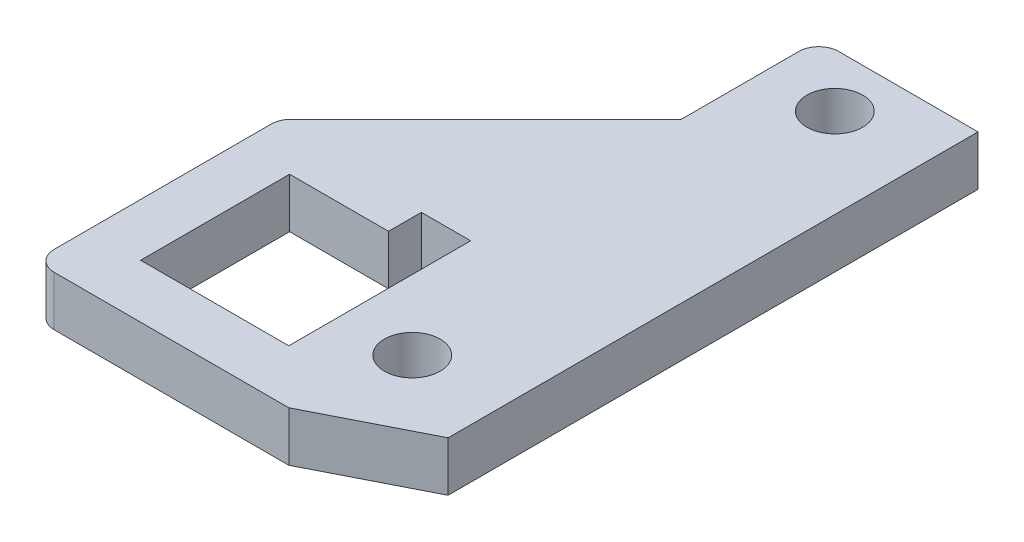
ISO-10303-21;
HEADER;
FILE_DESCRIPTION(('STEP AP214'),'2;1');
FILE_NAME('part.step','',(''),(''),'','','');
FILE_SCHEMA(('AUTOMOTIVE_DESIGN { 1 0 10303 214 1 1 1 1 }'));
ENDSEC;
DATA;
#1=APPLICATION_CONTEXT('core data for automotive mechanical design processes');
#2=APPLICATION_PROTOCOL_DEFINITION('international standard','automotive_design',2000,#1);
#3=PRODUCT_CONTEXT('',#1,'mechanical');
#4=PRODUCT('Part','Part','',(#3));
#5=PRODUCT_RELATED_PRODUCT_CATEGORY('part','',(#4));
#6=PRODUCT_DEFINITION_FORMATION('','',#4);
#7=PRODUCT_DEFINITION_CONTEXT('part definition',#1,'design');
#8=PRODUCT_DEFINITION('design','',#6,#7);
#9=PRODUCT_DEFINITION_SHAPE('','',#8);
#10=(LENGTH_UNIT() NAMED_UNIT(*) SI_UNIT(.MILLI.,.METRE.));
#11=(NAMED_UNIT(*) PLANE_ANGLE_UNIT() SI_UNIT($,.RADIAN.));
#12=(NAMED_UNIT(*) SI_UNIT($,.STERADIAN.) SOLID_ANGLE_UNIT());
#13=UNCERTAINTY_MEASURE_WITH_UNIT(LENGTH_MEASURE(1.E-05),#10,'distance_accuracy_value','');
#14=(GEOMETRIC_REPRESENTATION_CONTEXT(3) GLOBAL_UNCERTAINTY_ASSIGNED_CONTEXT((#13)) GLOBAL_UNIT_ASSIGNED_CONTEXT((#10,
#11,#12)) REPRESENTATION_CONTEXT('',''));
#15=CARTESIAN_POINT('',(0.,0.,0.));
#16=DIRECTION('',(0.,0.,1.));
#17=DIRECTION('',(1.,0.,0.));
#18=AXIS2_PLACEMENT_3D('',#15,#16,#17);
#19=CARTESIAN_POINT('',(1.27,3.175,-1.27));
#20=DIRECTION('',(0.,-1.,0.));
#21=DIRECTION('',(0.,0.,-1.));
#22=AXIS2_PLACEMENT_3D('',#19,#20,#21);
#23=CYLINDRICAL_SURFACE('',#22,1.27);
#24=CARTESIAN_POINT('',(1.27,0.,-1.27));
#25=DIRECTION('',(0.,-1.,0.));
#26=DIRECTION('',(0.,0.,-1.));
#27=AXIS2_PLACEMENT_3D('',#24,#25,#26);
#28=CIRCLE('',#27,1.27);
#29=CARTESIAN_POINT('',(1.27,0.,0.));
#30=VERTEX_POINT('',#29);
#31=CARTESIAN_POINT('',(0.,0.,-1.27));
#32=VERTEX_POINT('',#31);
#33=EDGE_CURVE('E195',#30,#32,#28,.T.);
#34=ORIENTED_EDGE('',*,*,#33,.F.);
#35=DIRECTION('',(0.,-1.,0.));
#36=VECTOR('',#35,1.);
#37=CARTESIAN_POINT('',(1.27,3.175,0.));
#38=LINE('',#37,#36);
#39=CARTESIAN_POINT('',(1.27,3.175,0.));
#40=VERTEX_POINT('',#39);
#41=EDGE_CURVE('E11',#40,#30,#38,.T.);
#42=ORIENTED_EDGE('',*,*,#41,.F.);
#43=CARTESIAN_POINT('',(1.27,3.175,-1.27));
#44=DIRECTION('',(0.,-1.,0.));
#45=DIRECTION('',(0.,0.,-1.));
#46=AXIS2_PLACEMENT_3D('',#43,#44,#45);
#47=CIRCLE('',#46,1.27);
#48=CARTESIAN_POINT('',(0.,3.175,-1.27));
#49=VERTEX_POINT('',#48);
#50=EDGE_CURVE('E203',#40,#49,#47,.T.);
#51=ORIENTED_EDGE('',*,*,#50,.T.);
#52=DIRECTION('',(0.,-1.,0.));
#53=VECTOR('',#52,1.);
#54=CARTESIAN_POINT('',(0.,3.175,-1.27));
#55=LINE('',#54,#53);
#56=EDGE_CURVE('E36',#49,#32,#55,.T.);
#57=ORIENTED_EDGE('',*,*,#56,.T.);
#58=EDGE_LOOP('',(#34,#42,#51,#57));
#59=FACE_BOUND('',#58,.T.);
#60=ADVANCED_FACE('F33',(#59),#23,.T.);
#61=CARTESIAN_POINT('',(16.2239556670893,3.175,0.));
#62=DIRECTION('',(0.,0.,1.));
#63=DIRECTION('',(1.,0.,0.));
#64=AXIS2_PLACEMENT_3D('',#61,#62,#63);
#65=PLANE('',#64);
#66=DIRECTION('',(-1.,0.,0.));
#67=VECTOR('',#66,1.);
#68=CARTESIAN_POINT('',(16.2239556670893,0.,0.));
#69=LINE('',#68,#67);
#70=CARTESIAN_POINT('',(16.2239556670893,0.,0.));
#71=VERTEX_POINT('',#70);
#72=EDGE_CURVE('E207',#71,#30,#69,.T.);
#73=ORIENTED_EDGE('',*,*,#72,.F.);
#74=DIRECTION('',(0.,-1.,0.));
#75=VECTOR('',#74,1.);
#76=CARTESIAN_POINT('',(16.2239556670893,3.175,0.));
#77=LINE('',#76,#75);
#78=CARTESIAN_POINT('',(16.2239556670893,3.175,0.));
#79=VERTEX_POINT('',#78);
#80=EDGE_CURVE('E41',#79,#71,#77,.T.);
#81=ORIENTED_EDGE('',*,*,#80,.F.);
#82=DIRECTION('',(-1.,0.,0.));
#83=VECTOR('',#82,1.);
#84=CARTESIAN_POINT('',(16.2239556670893,3.175,0.));
#85=LINE('',#84,#83);
#86=EDGE_CURVE('E231',#79,#40,#85,.T.);
#87=ORIENTED_EDGE('',*,*,#86,.T.);
#88=ORIENTED_EDGE('',*,*,#41,.T.);
#89=EDGE_LOOP('',(#73,#81,#87,#88));
#90=FACE_BOUND('',#89,.T.);
#91=ADVANCED_FACE('F288',(#90),#65,.T.);
#92=CARTESIAN_POINT('',(22.9633593823173,3.175,-3.42057377293219));
#93=DIRECTION('',(0.452590350451546,0.,0.891718551269483));
#94=DIRECTION('',(0.891718551269483,0.,-0.452590350451546));
#95=AXIS2_PLACEMENT_3D('',#92,#93,#94);
#96=PLANE('',#95);
#97=DIRECTION('',(-0.891718551269483,0.,0.452590350451546));
#98=VECTOR('',#97,1.);
#99=CARTESIAN_POINT('',(22.9633593823173,0.,-3.42057377293219));
#100=LINE('',#99,#98);
#101=CARTESIAN_POINT('',(22.9633593823173,0.,-3.42057377293219));
#102=VERTEX_POINT('',#101);
#103=EDGE_CURVE('E257',#102,#71,#100,.T.);
#104=ORIENTED_EDGE('',*,*,#103,.F.);
#105=DIRECTION('',(0.,-1.,0.));
#106=VECTOR('',#105,1.);
#107=CARTESIAN_POINT('',(22.9633593823173,3.175,-3.42057377293219));
#108=LINE('',#107,#106);
#109=CARTESIAN_POINT('',(22.9633593823173,3.175,-3.42057377293219));
#110=VERTEX_POINT('',#109);
#111=EDGE_CURVE('E263',#110,#102,#108,.T.);
#112=ORIENTED_EDGE('',*,*,#111,.F.);
#113=DIRECTION('',(-0.891718551269483,0.,0.452590350451546));
#114=VECTOR('',#113,1.);
#115=CARTESIAN_POINT('',(22.9633593823173,3.175,-3.42057377293219));
#116=LINE('',#115,#114);
#117=EDGE_CURVE('E228',#110,#79,#116,.T.);
#118=ORIENTED_EDGE('',*,*,#117,.T.);
#119=ORIENTED_EDGE('',*,*,#80,.T.);
#120=EDGE_LOOP('',(#104,#112,#118,#119));
#121=FACE_BOUND('',#120,.T.);
#122=ADVANCED_FACE('F315',(#121),#96,.T.);
#123=CARTESIAN_POINT('',(22.9633593823173,3.175,-37.2025926));
#124=DIRECTION('',(1.,0.,0.));
#125=DIRECTION('',(0.,0.,-1.));
#126=AXIS2_PLACEMENT_3D('',#123,#124,#125);
#127=PLANE('',#126);
#128=DIRECTION('',(0.,0.,1.));
#129=VECTOR('',#128,1.);
#130=CARTESIAN_POINT('',(22.9633593823173,0.,-37.2025926));
#131=LINE('',#130,#129);
#132=CARTESIAN_POINT('',(22.9633593823173,0.,-37.2025926));
#133=VERTEX_POINT('',#132);
#134=EDGE_CURVE('E254',#133,#102,#131,.T.);
#135=ORIENTED_EDGE('',*,*,#134,.F.);
#136=DIRECTION('',(0.,-1.,0.));
#137=VECTOR('',#136,1.);
#138=CARTESIAN_POINT('',(22.9633593823173,3.175,-37.2025926));
#139=LINE('',#138,#137);
#140=CARTESIAN_POINT('',(22.9633593823173,3.175,-37.2025926));
#141=VERTEX_POINT('',#140);
#142=EDGE_CURVE('E265',#141,#133,#139,.T.);
#143=ORIENTED_EDGE('',*,*,#142,.F.);
#144=DIRECTION('',(0.,0.,1.));
#145=VECTOR('',#144,1.);
#146=CARTESIAN_POINT('',(22.9633593823173,3.175,-37.2025926));
#147=LINE('',#146,#145);
#148=EDGE_CURVE('E225',#141,#110,#147,.T.);
#149=ORIENTED_EDGE('',*,*,#148,.T.);
#150=ORIENTED_EDGE('',*,*,#111,.T.);
#151=EDGE_LOOP('',(#135,#143,#149,#150));
#152=FACE_BOUND('',#151,.T.);
#153=ADVANCED_FACE('F313',(#152),#127,.T.);
#154=CARTESIAN_POINT('',(14.0812333823173,3.175,-37.2025926));
#155=DIRECTION('',(0.,0.,-1.));
#156=DIRECTION('',(-1.,0.,0.));
#157=AXIS2_PLACEMENT_3D('',#154,#155,#156);
#158=PLANE('',#157);
#159=DIRECTION('',(1.,0.,0.));
#160=VECTOR('',#159,1.);
#161=CARTESIAN_POINT('',(14.0812333823173,0.,-37.2025926));
#162=LINE('',#161,#160);
#163=CARTESIAN_POINT('',(14.0812333823173,0.,-37.2025926));
#164=VERTEX_POINT('',#163);
#165=EDGE_CURVE('E251',#164,#133,#162,.T.);
#166=ORIENTED_EDGE('',*,*,#165,.F.);
#167=DIRECTION('',(0.,-1.,0.));
#168=VECTOR('',#167,1.);
#169=CARTESIAN_POINT('',(14.0812333823173,3.175,-37.2025926));
#170=LINE('',#169,#168);
#171=CARTESIAN_POINT('',(14.0812333823173,3.175,-37.2025926));
#172=VERTEX_POINT('',#171);
#173=EDGE_CURVE('E267',#172,#164,#170,.T.);
#174=ORIENTED_EDGE('',*,*,#173,.F.);
#175=DIRECTION('',(1.,0.,0.));
#176=VECTOR('',#175,1.);
#177=CARTESIAN_POINT('',(14.0812333823173,3.175,-37.2025926));
#178=LINE('',#177,#176);
#179=EDGE_CURVE('E222',#172,#141,#178,.T.);
#180=ORIENTED_EDGE('',*,*,#179,.T.);
#181=ORIENTED_EDGE('',*,*,#142,.T.);
#182=EDGE_LOOP('',(#166,#174,#180,#181));
#183=FACE_BOUND('',#182,.T.);
#184=ADVANCED_FACE('F309',(#183),#158,.T.);
#185=CARTESIAN_POINT('',(14.0812333823173,3.175,-35.9325926));
#186=DIRECTION('',(0.,-1.,0.));
#187=DIRECTION('',(0.,0.,-1.));
#188=AXIS2_PLACEMENT_3D('',#185,#186,#187);
#189=CYLINDRICAL_SURFACE('',#188,1.27);
#190=CARTESIAN_POINT('',(14.0812333823173,0.,-35.9325926));
#191=DIRECTION('',(0.,-1.,0.));
#192=DIRECTION('',(0.,0.,-1.));
#193=AXIS2_PLACEMENT_3D('',#190,#191,#192);
#194=CIRCLE('',#193,1.27);
#195=CARTESIAN_POINT('',(12.8112333823173,0.,-35.9325926));
#196=VERTEX_POINT('',#195);
#197=EDGE_CURVE('E248',#196,#164,#194,.T.);
#198=ORIENTED_EDGE('',*,*,#197,.F.);
#199=DIRECTION('',(0.,-1.,0.));
#200=VECTOR('',#199,1.);
#201=CARTESIAN_POINT('',(12.8112333823173,3.175,-35.9325926));
#202=LINE('',#201,#200);
#203=CARTESIAN_POINT('',(12.8112333823173,3.175,-35.9325926));
#204=VERTEX_POINT('',#203);
#205=EDGE_CURVE('E269',#204,#196,#202,.T.);
#206=ORIENTED_EDGE('',*,*,#205,.F.);
#207=CARTESIAN_POINT('',(14.0812333823173,3.175,-35.9325926));
#208=DIRECTION('',(0.,-1.,0.));
#209=DIRECTION('',(0.,0.,-1.));
#210=AXIS2_PLACEMENT_3D('',#207,#208,#209);
#211=CIRCLE('',#210,1.27);
#212=EDGE_CURVE('E219',#204,#172,#211,.T.);
#213=ORIENTED_EDGE('',*,*,#212,.T.);
#214=ORIENTED_EDGE('',*,*,#173,.T.);
#215=EDGE_LOOP('',(#198,#206,#213,#214));
#216=FACE_BOUND('',#215,.T.);
#217=ADVANCED_FACE('F305',(#216),#189,.T.);
#218=CARTESIAN_POINT('',(12.8112333823173,3.175,-28.4334966));
#219=DIRECTION('',(-1.,0.,0.));
#220=DIRECTION('',(0.,0.,1.));
#221=AXIS2_PLACEMENT_3D('',#218,#219,#220);
#222=PLANE('',#221);
#223=DIRECTION('',(0.,0.,-1.));
#224=VECTOR('',#223,1.);
#225=CARTESIAN_POINT('',(12.8112333823173,0.,-28.4334966));
#226=LINE('',#225,#224);
#227=CARTESIAN_POINT('',(12.8112333823173,0.,-28.4334966));
#228=VERTEX_POINT('',#227);
#229=EDGE_CURVE('E245',#228,#196,#226,.T.);
#230=ORIENTED_EDGE('',*,*,#229,.F.);
#231=DIRECTION('',(0.,-1.,0.));
#232=VECTOR('',#231,1.);
#233=CARTESIAN_POINT('',(12.8112333823173,3.175,-28.4334966));
#234=LINE('',#233,#232);
#235=CARTESIAN_POINT('',(12.8112333823173,3.175,-28.4334966));
#236=VERTEX_POINT('',#235);
#237=EDGE_CURVE('E271',#236,#228,#234,.T.);
#238=ORIENTED_EDGE('',*,*,#237,.F.);
#239=DIRECTION('',(0.,0.,-1.));
#240=VECTOR('',#239,1.);
#241=CARTESIAN_POINT('',(12.8112333823173,3.175,-28.4334966));
#242=LINE('',#241,#240);
#243=EDGE_CURVE('E216',#236,#204,#242,.T.);
#244=ORIENTED_EDGE('',*,*,#243,.T.);
#245=ORIENTED_EDGE('',*,*,#205,.T.);
#246=EDGE_LOOP('',(#230,#238,#244,#245));
#247=FACE_BOUND('',#246,.T.);
#248=ADVANCED_FACE('F301',(#247),#222,.T.);
#249=CARTESIAN_POINT('',(0.371974387893079,3.175,-15.9942376055759));
#250=DIRECTION('',(-0.707106781186546,0.,-0.707106781186549));
#251=DIRECTION('',(-0.707106781186549,0.,0.707106781186546));
#252=AXIS2_PLACEMENT_3D('',#249,#250,#251);
#253=PLANE('',#252);
#254=DIRECTION('',(0.707106781186549,0.,-0.707106781186546));
#255=VECTOR('',#254,1.);
#256=CARTESIAN_POINT('',(0.371974387893079,0.,-15.9942376055759));
#257=LINE('',#256,#255);
#258=CARTESIAN_POINT('',(0.371974387893079,0.,-15.9942376055759));
#259=VERTEX_POINT('',#258);
#260=EDGE_CURVE('E242',#259,#228,#257,.T.);
#261=ORIENTED_EDGE('',*,*,#260,.F.);
#262=DIRECTION('',(0.,-1.,0.));
#263=VECTOR('',#262,1.);
#264=CARTESIAN_POINT('',(0.371974387893079,3.175,-15.9942376055759));
#265=LINE('',#264,#263);
#266=CARTESIAN_POINT('',(0.371974387893079,3.175,-15.9942376055759));
#267=VERTEX_POINT('',#266);
#268=EDGE_CURVE('E273',#267,#259,#265,.T.);
#269=ORIENTED_EDGE('',*,*,#268,.F.);
#270=DIRECTION('',(0.707106781186549,0.,-0.707106781186546));
#271=VECTOR('',#270,1.);
#272=CARTESIAN_POINT('',(0.371974387893079,3.175,-15.9942376055759));
#273=LINE('',#272,#271);
#274=EDGE_CURVE('E213',#267,#236,#273,.T.);
#275=ORIENTED_EDGE('',*,*,#274,.T.);
#276=ORIENTED_EDGE('',*,*,#237,.T.);
#277=EDGE_LOOP('',(#261,#269,#275,#276));
#278=FACE_BOUND('',#277,.T.);
#279=ADVANCED_FACE('F299',(#278),#253,.T.);
#280=CARTESIAN_POINT('',(1.26999999999999,3.175,-15.096211993469));
#281=DIRECTION('',(0.,-1.,0.));
#282=DIRECTION('',(0.,0.,-1.));
#283=AXIS2_PLACEMENT_3D('',#280,#281,#282);
#284=CYLINDRICAL_SURFACE('',#283,1.27);
#285=CARTESIAN_POINT('',(1.26999999999999,0.,-15.096211993469));
#286=DIRECTION('',(0.,-1.,0.));
#287=DIRECTION('',(0.,0.,-1.));
#288=AXIS2_PLACEMENT_3D('',#285,#286,#287);
#289=CIRCLE('',#288,1.27);
#290=CARTESIAN_POINT('',(0.,0.,-15.096211993469));
#291=VERTEX_POINT('',#290);
#292=EDGE_CURVE('E239',#291,#259,#289,.T.);
#293=ORIENTED_EDGE('',*,*,#292,.F.);
#294=DIRECTION('',(0.,-1.,0.));
#295=VECTOR('',#294,1.);
#296=CARTESIAN_POINT('',(0.,3.175,-15.096211993469));
#297=LINE('',#296,#295);
#298=CARTESIAN_POINT('',(0.,3.175,-15.096211993469));
#299=VERTEX_POINT('',#298);
#300=EDGE_CURVE('E274',#299,#291,#297,.T.);
#301=ORIENTED_EDGE('',*,*,#300,.F.);
#302=CARTESIAN_POINT('',(1.26999999999999,3.175,-15.096211993469));
#303=DIRECTION('',(0.,-1.,0.));
#304=DIRECTION('',(0.,0.,-1.));
#305=AXIS2_PLACEMENT_3D('',#302,#303,#304);
#306=CIRCLE('',#305,1.27);
#307=EDGE_CURVE('E210',#299,#267,#306,.T.);
#308=ORIENTED_EDGE('',*,*,#307,.T.);
#309=ORIENTED_EDGE('',*,*,#268,.T.);
#310=EDGE_LOOP('',(#293,#301,#308,#309));
#311=FACE_BOUND('',#310,.T.);
#312=ADVANCED_FACE('F295',(#311),#284,.T.);
#313=CARTESIAN_POINT('',(0.,3.175,-1.27));
#314=DIRECTION('',(-1.,0.,0.));
#315=DIRECTION('',(0.,0.,1.));
#316=AXIS2_PLACEMENT_3D('',#313,#314,#315);
#317=PLANE('',#316);
#318=DIRECTION('',(0.,0.,-1.));
#319=VECTOR('',#318,1.);
#320=CARTESIAN_POINT('',(0.,0.,-1.27));
#321=LINE('',#320,#319);
#322=EDGE_CURVE('E236',#32,#291,#321,.T.);
#323=ORIENTED_EDGE('',*,*,#322,.F.);
#324=ORIENTED_EDGE('',*,*,#56,.F.);
#325=DIRECTION('',(0.,0.,-1.));
#326=VECTOR('',#325,1.);
#327=CARTESIAN_POINT('',(0.,3.175,-1.27));
#328=LINE('',#327,#326);
#329=EDGE_CURVE('E206',#49,#299,#328,.T.);
#330=ORIENTED_EDGE('',*,*,#329,.T.);
#331=ORIENTED_EDGE('',*,*,#300,.T.);
#332=EDGE_LOOP('',(#323,#324,#330,#331));
#333=FACE_BOUND('',#332,.T.);
#334=ADVANCED_FACE('F282',(#333),#317,.T.);
#335=CARTESIAN_POINT('',(1.27,3.175,-1.27));
#336=DIRECTION('',(0.,-1.,0.));
#337=DIRECTION('',(0.,0.,-1.));
#338=AXIS2_PLACEMENT_3D('',#335,#336,#337);
#339=PLANE('',#338);
#340=CARTESIAN_POINT('',(17.2559793823173,3.175,-6.84044423679253));
#341=DIRECTION('',(0.,-1.,0.));
#342=DIRECTION('',(0.,0.,1.));
#343=AXIS2_PLACEMENT_3D('',#340,#341,#342);
#344=CIRCLE('',#343,1.778);
#345=CARTESIAN_POINT('',(17.2559793823173,3.175,-5.06244423679253));
#346=VERTEX_POINT('',#345);
#347=EDGE_CURVE('E488',#346,#346,#344,.T.);
#348=ORIENTED_EDGE('',*,*,#347,.T.);
#349=EDGE_LOOP('',(#348));
#350=FACE_BOUND('',#349,.T.);
#351=CARTESIAN_POINT('',(17.2559793823173,3.175,-33.7812126));
#352=DIRECTION('',(0.,-1.,0.));
#353=DIRECTION('',(0.,0.,1.));
#354=AXIS2_PLACEMENT_3D('',#351,#352,#353);
#355=CIRCLE('',#354,1.77800000000001);
#356=CARTESIAN_POINT('',(17.2559793823173,3.175,-32.0032126));
#357=VERTEX_POINT('',#356);
#358=EDGE_CURVE('E183',#357,#357,#355,.T.);
#359=ORIENTED_EDGE('',*,*,#358,.T.);
#360=EDGE_LOOP('',(#359));
#361=FACE_BOUND('',#360,.T.);
#362=DIRECTION('',(1.,0.,0.));
#363=VECTOR('',#362,1.);
#364=CARTESIAN_POINT('',(9.66215999999999,3.175,-12.92098));
#365=LINE('',#364,#363);
#366=CARTESIAN_POINT('',(3.35787999999999,3.175,-12.92098));
#367=VERTEX_POINT('',#366);
#368=CARTESIAN_POINT('',(9.66215999999999,3.175,-12.92098));
#369=VERTEX_POINT('',#368);
#370=EDGE_CURVE('E154',#367,#369,#365,.T.);
#371=ORIENTED_EDGE('',*,*,#370,.T.);
#372=DIRECTION('',(0.,0.,-1.));
#373=VECTOR('',#372,1.);
#374=CARTESIAN_POINT('',(9.66215999999999,3.175,-15.01648));
#375=LINE('',#374,#373);
#376=CARTESIAN_POINT('',(9.66215999999999,3.175,-15.01648));
#377=VERTEX_POINT('',#376);
#378=EDGE_CURVE('E148',#369,#377,#375,.T.);
#379=ORIENTED_EDGE('',*,*,#378,.T.);
#380=DIRECTION('',(1.,0.,0.));
#381=VECTOR('',#380,1.);
#382=CARTESIAN_POINT('',(12.80414,3.175,-15.01648));
#383=LINE('',#382,#381);
#384=CARTESIAN_POINT('',(12.80414,3.175,-15.01648));
#385=VERTEX_POINT('',#384);
#386=EDGE_CURVE('E157',#377,#385,#383,.T.);
#387=ORIENTED_EDGE('',*,*,#386,.T.);
#388=DIRECTION('',(0.,0.,1.));
#389=VECTOR('',#388,1.);
#390=CARTESIAN_POINT('',(12.80414,3.175,-3.42138));
#391=LINE('',#390,#389);
#392=CARTESIAN_POINT('',(12.80414,3.175,-3.42138));
#393=VERTEX_POINT('',#392);
#394=EDGE_CURVE('E49',#385,#393,#391,.T.);
#395=ORIENTED_EDGE('',*,*,#394,.T.);
#396=DIRECTION('',(-1.,0.,0.));
#397=VECTOR('',#396,1.);
#398=CARTESIAN_POINT('',(3.35787999999999,3.175,-3.42138));
#399=LINE('',#398,#397);
#400=CARTESIAN_POINT('',(3.35787999999999,3.175,-3.42138));
#401=VERTEX_POINT('',#400);
#402=EDGE_CURVE('E175',#393,#401,#399,.T.);
#403=ORIENTED_EDGE('',*,*,#402,.T.);
#404=DIRECTION('',(0.,0.,-1.));
#405=VECTOR('',#404,1.);
#406=CARTESIAN_POINT('',(3.35787999999999,3.175,-12.92098));
#407=LINE('',#406,#405);
#408=EDGE_CURVE('E178',#401,#367,#407,.T.);
#409=ORIENTED_EDGE('',*,*,#408,.T.);
#410=EDGE_LOOP('',(#371,#379,#387,#395,#403,#409));
#411=FACE_BOUND('',#410,.T.);
#412=ORIENTED_EDGE('',*,*,#50,.F.);
#413=ORIENTED_EDGE('',*,*,#86,.F.);
#414=ORIENTED_EDGE('',*,*,#117,.F.);
#415=ORIENTED_EDGE('',*,*,#148,.F.);
#416=ORIENTED_EDGE('',*,*,#179,.F.);
#417=ORIENTED_EDGE('',*,*,#212,.F.);
#418=ORIENTED_EDGE('',*,*,#243,.F.);
#419=ORIENTED_EDGE('',*,*,#274,.F.);
#420=ORIENTED_EDGE('',*,*,#307,.F.);
#421=ORIENTED_EDGE('',*,*,#329,.F.);
#422=EDGE_LOOP('',(#412,#413,#414,#415,#416,#417,#418,#419,#420,#421));
#423=FACE_BOUND('',#422,.T.);
#424=ADVANCED_FACE('F161',(#350,#361,#411,#423),#339,.F.);
#425=CARTESIAN_POINT('',(1.27,0.,-1.27));
#426=DIRECTION('',(0.,-1.,0.));
#427=DIRECTION('',(0.,0.,-1.));
#428=AXIS2_PLACEMENT_3D('',#425,#426,#427);
#429=PLANE('',#428);
#430=CARTESIAN_POINT('',(17.2559793823173,0.,-6.84044423679253));
#431=DIRECTION('',(0.,-1.,0.));
#432=DIRECTION('',(0.,0.,1.));
#433=AXIS2_PLACEMENT_3D('',#430,#431,#432);
#434=CIRCLE('',#433,1.778);
#435=CARTESIAN_POINT('',(17.2559793823173,0.,-5.06244423679253));
#436=VERTEX_POINT('',#435);
#437=EDGE_CURVE('E491',#436,#436,#434,.T.);
#438=ORIENTED_EDGE('',*,*,#437,.F.);
#439=EDGE_LOOP('',(#438));
#440=FACE_BOUND('',#439,.T.);
#441=CARTESIAN_POINT('',(17.2559793823173,0.,-33.7812126));
#442=DIRECTION('',(0.,-1.,0.));
#443=DIRECTION('',(0.,0.,1.));
#444=AXIS2_PLACEMENT_3D('',#441,#442,#443);
#445=CIRCLE('',#444,1.77800000000001);
#446=CARTESIAN_POINT('',(17.2559793823173,0.,-32.0032126));
#447=VERTEX_POINT('',#446);
#448=EDGE_CURVE('E171',#447,#447,#445,.T.);
#449=ORIENTED_EDGE('',*,*,#448,.F.);
#450=EDGE_LOOP('',(#449));
#451=FACE_BOUND('',#450,.T.);
#452=DIRECTION('',(0.,0.,-1.));
#453=VECTOR('',#452,1.);
#454=CARTESIAN_POINT('',(9.66215999999999,0.,-15.01648));
#455=LINE('',#454,#453);
#456=CARTESIAN_POINT('',(9.66215999999999,0.,-12.92098));
#457=VERTEX_POINT('',#456);
#458=CARTESIAN_POINT('',(9.66215999999999,0.,-15.01648));
#459=VERTEX_POINT('',#458);
#460=EDGE_CURVE('E57',#457,#459,#455,.T.);
#461=ORIENTED_EDGE('',*,*,#460,.F.);
#462=DIRECTION('',(1.,0.,0.));
#463=VECTOR('',#462,1.);
#464=CARTESIAN_POINT('',(9.66215999999999,0.,-12.92098));
#465=LINE('',#464,#463);
#466=CARTESIAN_POINT('',(3.35787999999999,0.,-12.92098));
#467=VERTEX_POINT('',#466);
#468=EDGE_CURVE('E165',#467,#457,#465,.T.);
#469=ORIENTED_EDGE('',*,*,#468,.F.);
#470=DIRECTION('',(0.,0.,-1.));
#471=VECTOR('',#470,1.);
#472=CARTESIAN_POINT('',(3.35787999999999,0.,-12.92098));
#473=LINE('',#472,#471);
#474=CARTESIAN_POINT('',(3.35787999999999,0.,-3.42138));
#475=VERTEX_POINT('',#474);
#476=EDGE_CURVE('E168',#475,#467,#473,.T.);
#477=ORIENTED_EDGE('',*,*,#476,.F.);
#478=DIRECTION('',(-1.,0.,0.));
#479=VECTOR('',#478,1.);
#480=CARTESIAN_POINT('',(3.35787999999999,0.,-3.42138));
#481=LINE('',#480,#479);
#482=CARTESIAN_POINT('',(12.80414,0.,-3.42138));
#483=VERTEX_POINT('',#482);
#484=EDGE_CURVE('E188',#483,#475,#481,.T.);
#485=ORIENTED_EDGE('',*,*,#484,.F.);
#486=DIRECTION('',(0.,0.,1.));
#487=VECTOR('',#486,1.);
#488=CARTESIAN_POINT('',(12.80414,0.,-3.42138));
#489=LINE('',#488,#487);
#490=CARTESIAN_POINT('',(12.80414,0.,-15.01648));
#491=VERTEX_POINT('',#490);
#492=EDGE_CURVE('E185',#491,#483,#489,.T.);
#493=ORIENTED_EDGE('',*,*,#492,.F.);
#494=DIRECTION('',(1.,0.,0.));
#495=VECTOR('',#494,1.);
#496=CARTESIAN_POINT('',(12.80414,0.,-15.01648));
#497=LINE('',#496,#495);
#498=EDGE_CURVE('E182',#459,#491,#497,.T.);
#499=ORIENTED_EDGE('',*,*,#498,.F.);
#500=EDGE_LOOP('',(#461,#469,#477,#485,#493,#499));
#501=FACE_BOUND('',#500,.T.);
#502=ORIENTED_EDGE('',*,*,#33,.T.);
#503=ORIENTED_EDGE('',*,*,#322,.T.);
#504=ORIENTED_EDGE('',*,*,#292,.T.);
#505=ORIENTED_EDGE('',*,*,#260,.T.);
#506=ORIENTED_EDGE('',*,*,#229,.T.);
#507=ORIENTED_EDGE('',*,*,#197,.T.);
#508=ORIENTED_EDGE('',*,*,#165,.T.);
#509=ORIENTED_EDGE('',*,*,#134,.T.);
#510=ORIENTED_EDGE('',*,*,#103,.T.);
#511=ORIENTED_EDGE('',*,*,#72,.T.);
#512=EDGE_LOOP('',(#502,#503,#504,#505,#506,#507,#508,#509,#510,#511));
#513=FACE_BOUND('',#512,.T.);
#514=ADVANCED_FACE('F284',(#440,#451,#501,#513),#429,.T.);
#515=CARTESIAN_POINT('',(9.66215999999999,3.175,-15.01648));
#516=DIRECTION('',(-1.,0.,0.));
#517=DIRECTION('',(0.,0.,1.));
#518=AXIS2_PLACEMENT_3D('',#515,#516,#517);
#519=PLANE('',#518);
#520=ORIENTED_EDGE('',*,*,#460,.T.);
#521=DIRECTION('',(0.,-1.,0.));
#522=VECTOR('',#521,1.);
#523=CARTESIAN_POINT('',(9.66215999999999,3.175,-15.01648));
#524=LINE('',#523,#522);
#525=EDGE_CURVE('E144',#377,#459,#524,.T.);
#526=ORIENTED_EDGE('',*,*,#525,.F.);
#527=ORIENTED_EDGE('',*,*,#378,.F.);
#528=DIRECTION('',(0.,-1.,0.));
#529=VECTOR('',#528,1.);
#530=CARTESIAN_POINT('',(9.66215999999999,3.175,-12.92098));
#531=LINE('',#530,#529);
#532=EDGE_CURVE('E193',#369,#457,#531,.T.);
#533=ORIENTED_EDGE('',*,*,#532,.T.);
#534=EDGE_LOOP('',(#520,#526,#527,#533));
#535=FACE_BOUND('',#534,.T.);
#536=ADVANCED_FACE('F146',(#535),#519,.F.);
#537=CARTESIAN_POINT('',(9.66215999999999,3.175,-12.92098));
#538=DIRECTION('',(0.,0.,-1.));
#539=DIRECTION('',(-1.,0.,0.));
#540=AXIS2_PLACEMENT_3D('',#537,#538,#539);
#541=PLANE('',#540);
#542=ORIENTED_EDGE('',*,*,#468,.T.);
#543=ORIENTED_EDGE('',*,*,#532,.F.);
#544=ORIENTED_EDGE('',*,*,#370,.F.);
#545=DIRECTION('',(0.,-1.,0.));
#546=VECTOR('',#545,1.);
#547=CARTESIAN_POINT('',(3.35787999999999,3.175,-12.92098));
#548=LINE('',#547,#546);
#549=EDGE_CURVE('E196',#367,#467,#548,.T.);
#550=ORIENTED_EDGE('',*,*,#549,.T.);
#551=EDGE_LOOP('',(#542,#543,#544,#550));
#552=FACE_BOUND('',#551,.T.);
#553=ADVANCED_FACE('F415',(#552),#541,.F.);
#554=CARTESIAN_POINT('',(3.35787999999999,3.175,-12.92098));
#555=DIRECTION('',(-1.,0.,0.));
#556=DIRECTION('',(0.,0.,1.));
#557=AXIS2_PLACEMENT_3D('',#554,#555,#556);
#558=PLANE('',#557);
#559=ORIENTED_EDGE('',*,*,#476,.T.);
#560=ORIENTED_EDGE('',*,*,#549,.F.);
#561=ORIENTED_EDGE('',*,*,#408,.F.);
#562=DIRECTION('',(0.,-1.,0.));
#563=VECTOR('',#562,1.);
#564=CARTESIAN_POINT('',(3.35787999999999,3.175,-3.42138));
#565=LINE('',#564,#563);
#566=EDGE_CURVE('E198',#401,#475,#565,.T.);
#567=ORIENTED_EDGE('',*,*,#566,.T.);
#568=EDGE_LOOP('',(#559,#560,#561,#567));
#569=FACE_BOUND('',#568,.T.);
#570=ADVANCED_FACE('F424',(#569),#558,.F.);
#571=CARTESIAN_POINT('',(3.35787999999999,3.175,-3.42138));
#572=DIRECTION('',(0.,0.,1.));
#573=DIRECTION('',(1.,0.,0.));
#574=AXIS2_PLACEMENT_3D('',#571,#572,#573);
#575=PLANE('',#574);
#576=ORIENTED_EDGE('',*,*,#484,.T.);
#577=ORIENTED_EDGE('',*,*,#566,.F.);
#578=ORIENTED_EDGE('',*,*,#402,.F.);
#579=DIRECTION('',(0.,-1.,0.));
#580=VECTOR('',#579,1.);
#581=CARTESIAN_POINT('',(12.80414,3.175,-3.42138));
#582=LINE('',#581,#580);
#583=EDGE_CURVE('E200',#393,#483,#582,.T.);
#584=ORIENTED_EDGE('',*,*,#583,.T.);
#585=EDGE_LOOP('',(#576,#577,#578,#584));
#586=FACE_BOUND('',#585,.T.);
#587=ADVANCED_FACE('F434',(#586),#575,.F.);
#588=CARTESIAN_POINT('',(12.80414,3.175,-3.42138));
#589=DIRECTION('',(1.,0.,0.));
#590=DIRECTION('',(0.,0.,-1.));
#591=AXIS2_PLACEMENT_3D('',#588,#589,#590);
#592=PLANE('',#591);
#593=ORIENTED_EDGE('',*,*,#492,.T.);
#594=ORIENTED_EDGE('',*,*,#583,.F.);
#595=ORIENTED_EDGE('',*,*,#394,.F.);
#596=DIRECTION('',(0.,-1.,0.));
#597=VECTOR('',#596,1.);
#598=CARTESIAN_POINT('',(12.80414,3.175,-15.01648));
#599=LINE('',#598,#597);
#600=EDGE_CURVE('E153',#385,#491,#599,.T.);
#601=ORIENTED_EDGE('',*,*,#600,.T.);
#602=EDGE_LOOP('',(#593,#594,#595,#601));
#603=FACE_BOUND('',#602,.T.);
#604=ADVANCED_FACE('F444',(#603),#592,.F.);
#605=CARTESIAN_POINT('',(12.80414,3.175,-15.01648));
#606=DIRECTION('',(0.,0.,-1.));
#607=DIRECTION('',(-1.,0.,0.));
#608=AXIS2_PLACEMENT_3D('',#605,#606,#607);
#609=PLANE('',#608);
#610=ORIENTED_EDGE('',*,*,#498,.T.);
#611=ORIENTED_EDGE('',*,*,#600,.F.);
#612=ORIENTED_EDGE('',*,*,#386,.F.);
#613=ORIENTED_EDGE('',*,*,#525,.T.);
#614=EDGE_LOOP('',(#610,#611,#612,#613));
#615=FACE_BOUND('',#614,.T.);
#616=ADVANCED_FACE('F158',(#615),#609,.F.);
#617=CARTESIAN_POINT('',(17.2559793823173,3.175,-33.7812126));
#618=DIRECTION('',(0.,-1.,0.));
#619=DIRECTION('',(0.,0.,-1.));
#620=AXIS2_PLACEMENT_3D('',#617,#618,#619);
#621=CYLINDRICAL_SURFACE('',#620,1.77800000000001);
#622=ORIENTED_EDGE('',*,*,#358,.F.);
#623=EDGE_LOOP('',(#622));
#624=FACE_BOUND('',#623,.T.);
#625=ORIENTED_EDGE('',*,*,#448,.T.);
#626=EDGE_LOOP('',(#625));
#627=FACE_BOUND('',#626,.T.);
#628=ADVANCED_FACE('F462',(#624,#627),#621,.F.);
#629=CARTESIAN_POINT('',(17.2559793823173,3.175,-6.84044423679253));
#630=DIRECTION('',(0.,-1.,0.));
#631=DIRECTION('',(0.,0.,-1.));
#632=AXIS2_PLACEMENT_3D('',#629,#630,#631);
#633=CYLINDRICAL_SURFACE('',#632,1.778);
#634=ORIENTED_EDGE('',*,*,#347,.F.);
#635=EDGE_LOOP('',(#634));
#636=FACE_BOUND('',#635,.T.);
#637=ORIENTED_EDGE('',*,*,#437,.T.);
#638=EDGE_LOOP('',(#637));
#639=FACE_BOUND('',#638,.T.);
#640=ADVANCED_FACE('F471',(#636,#639),#633,.F.);
#641=CLOSED_SHELL('',(#60,#91,#122,#153,#184,#217,#248,#279,#312,#334,#424,#514,#536,#553,#570,
#587,#604,#616,#628,#640));
#642=MANIFOLD_SOLID_BREP('B2',#641);
#643=ADVANCED_BREP_SHAPE_REPRESENTATION('',(#18,#642),#14);
#644=SHAPE_DEFINITION_REPRESENTATION(#9,#643);
ENDSEC;
END-ISO-10303-21;
